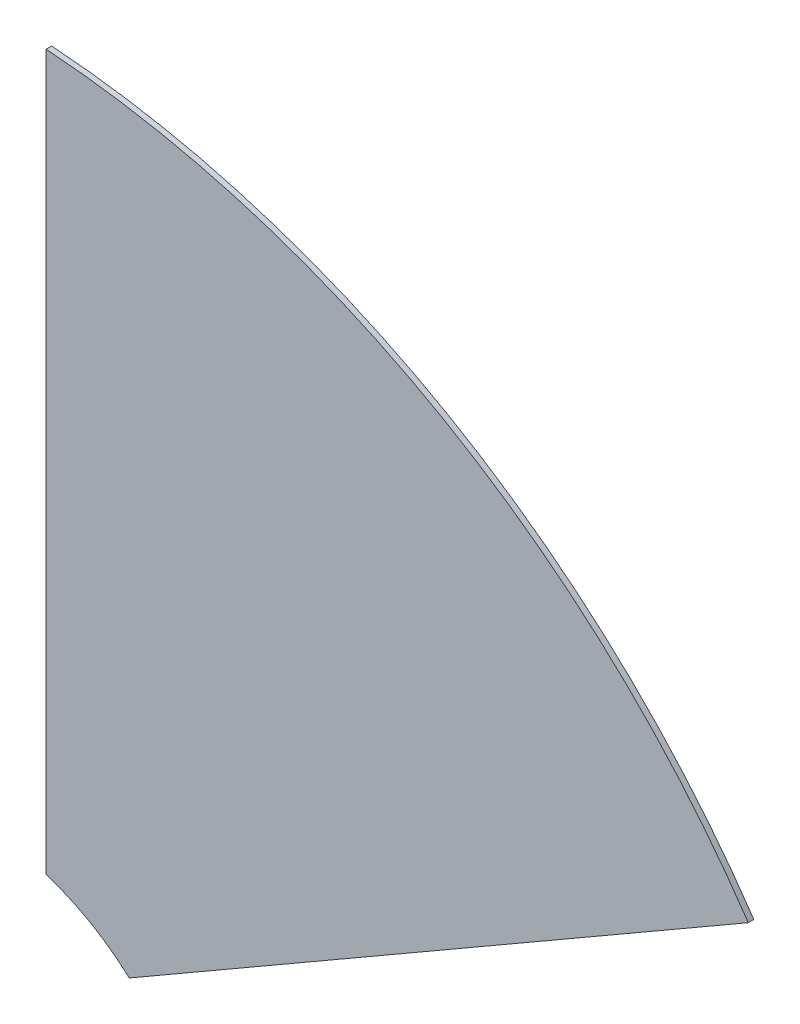
ISO-10303-21;
HEADER;
FILE_DESCRIPTION(('STEP AP214'),'2;1');
FILE_NAME('part.step','',(''),(''),'','','');
FILE_SCHEMA(('AUTOMOTIVE_DESIGN { 1 0 10303 214 1 1 1 1 }'));
ENDSEC;
DATA;
#1=APPLICATION_CONTEXT('core data for automotive mechanical design processes');
#2=APPLICATION_PROTOCOL_DEFINITION('international standard','automotive_design',2000,#1);
#3=PRODUCT_CONTEXT('',#1,'mechanical');
#4=PRODUCT('Part','Part','',(#3));
#5=PRODUCT_RELATED_PRODUCT_CATEGORY('part','',(#4));
#6=PRODUCT_DEFINITION_FORMATION('','',#4);
#7=PRODUCT_DEFINITION_CONTEXT('part definition',#1,'design');
#8=PRODUCT_DEFINITION('design','',#6,#7);
#9=PRODUCT_DEFINITION_SHAPE('','',#8);
#10=(LENGTH_UNIT() NAMED_UNIT(*) SI_UNIT(.MILLI.,.METRE.));
#11=(NAMED_UNIT(*) PLANE_ANGLE_UNIT() SI_UNIT($,.RADIAN.));
#12=(NAMED_UNIT(*) SI_UNIT($,.STERADIAN.) SOLID_ANGLE_UNIT());
#13=UNCERTAINTY_MEASURE_WITH_UNIT(LENGTH_MEASURE(1.E-05),#10,'distance_accuracy_value','');
#14=(GEOMETRIC_REPRESENTATION_CONTEXT(3) GLOBAL_UNCERTAINTY_ASSIGNED_CONTEXT((#13)) GLOBAL_UNIT_ASSIGNED_CONTEXT((#10,
#11,#12)) REPRESENTATION_CONTEXT('',''));
#15=CARTESIAN_POINT('',(0.,0.,0.));
#16=DIRECTION('',(0.,0.,1.));
#17=DIRECTION('',(1.,0.,0.));
#18=AXIS2_PLACEMENT_3D('',#15,#16,#17);
#19=CARTESIAN_POINT('',(-9.99200722162641E-13,-1.66533453693773E-12,1.5875));
#20=DIRECTION('',(0.,0.,-1.));
#21=DIRECTION('',(-1.,0.,0.));
#22=AXIS2_PLACEMENT_3D('',#19,#20,#21);
#23=CYLINDRICAL_SURFACE('',#22,266.700000000002);
#24=CARTESIAN_POINT('',(-9.99200722162641E-13,-1.66533453693773E-12,0.));
#25=DIRECTION('',(0.,0.,1.));
#26=DIRECTION('',(-1.,0.,0.));
#27=AXIS2_PLACEMENT_3D('',#24,#25,#26);
#28=CIRCLE('',#27,266.700000000002);
#29=CARTESIAN_POINT('',(220.854015157631,149.507170358992,0.));
#30=VERTEX_POINT('',#29);
#31=CARTESIAN_POINT('',(19.05,266.018772833798,0.));
#32=VERTEX_POINT('',#31);
#33=EDGE_CURVE('E97',#30,#32,#28,.T.);
#34=ORIENTED_EDGE('',*,*,#33,.T.);
#35=DIRECTION('',(0.,0.,-1.));
#36=VECTOR('',#35,1.);
#37=CARTESIAN_POINT('',(19.05,266.018772833798,1.5875));
#38=LINE('',#37,#36);
#39=CARTESIAN_POINT('',(19.05,266.018772833798,1.5875));
#40=VERTEX_POINT('',#39);
#41=EDGE_CURVE('E11',#40,#32,#38,.T.);
#42=ORIENTED_EDGE('',*,*,#41,.F.);
#43=CARTESIAN_POINT('',(-9.99200722162641E-13,-1.66533453693773E-12,1.5875));
#44=DIRECTION('',(0.,0.,1.));
#45=DIRECTION('',(-1.,0.,0.));
#46=AXIS2_PLACEMENT_3D('',#43,#44,#45);
#47=CIRCLE('',#46,266.700000000002);
#48=CARTESIAN_POINT('',(220.854015157631,149.507170358992,1.5875));
#49=VERTEX_POINT('',#48);
#50=EDGE_CURVE('E85',#49,#40,#47,.T.);
#51=ORIENTED_EDGE('',*,*,#50,.F.);
#52=DIRECTION('',(0.,0.,-1.));
#53=VECTOR('',#52,1.);
#54=CARTESIAN_POINT('',(220.854015157631,149.507170358992,1.5875));
#55=LINE('',#54,#53);
#56=EDGE_CURVE('E93',#49,#30,#55,.T.);
#57=ORIENTED_EDGE('',*,*,#56,.T.);
#58=EDGE_LOOP('',(#34,#42,#51,#57));
#59=FACE_BOUND('',#58,.T.);
#60=ADVANCED_FACE('F34',(#59),#23,.T.);
#61=CARTESIAN_POINT('',(19.05,266.018772833798,1.5875));
#62=DIRECTION('',(1.,0.,0.));
#63=DIRECTION('',(0.,1.,0.));
#64=AXIS2_PLACEMENT_3D('',#61,#62,#63);
#65=PLANE('',#64);
#66=DIRECTION('',(0.,-1.,0.));
#67=VECTOR('',#66,1.);
#68=CARTESIAN_POINT('',(19.05,266.018772833798,0.));
#69=LINE('',#68,#67);
#70=CARTESIAN_POINT('',(19.05,60.575139289976,0.));
#71=VERTEX_POINT('',#70);
#72=EDGE_CURVE('E89',#32,#71,#69,.T.);
#73=ORIENTED_EDGE('',*,*,#72,.T.);
#74=DIRECTION('',(0.,0.,-1.));
#75=VECTOR('',#74,1.);
#76=CARTESIAN_POINT('',(19.05,60.575139289976,1.5875));
#77=LINE('',#76,#75);
#78=CARTESIAN_POINT('',(19.05,60.575139289976,1.5875));
#79=VERTEX_POINT('',#78);
#80=EDGE_CURVE('E42',#79,#71,#77,.T.);
#81=ORIENTED_EDGE('',*,*,#80,.F.);
#82=DIRECTION('',(0.,-1.,0.));
#83=VECTOR('',#82,1.);
#84=CARTESIAN_POINT('',(19.05,266.018772833798,1.5875));
#85=LINE('',#84,#83);
#86=EDGE_CURVE('E80',#40,#79,#85,.T.);
#87=ORIENTED_EDGE('',*,*,#86,.F.);
#88=ORIENTED_EDGE('',*,*,#41,.T.);
#89=EDGE_LOOP('',(#73,#81,#87,#88));
#90=FACE_BOUND('',#89,.T.);
#91=ADVANCED_FACE('F88',(#90),#65,.F.);
#92=CARTESIAN_POINT('',(-3.78169717762944E-13,-6.86950496486816E-13,1.5875));
#93=DIRECTION('',(0.,0.,-1.));
#94=DIRECTION('',(-1.,0.,0.));
#95=AXIS2_PLACEMENT_3D('',#92,#93,#94);
#96=CYLINDRICAL_SURFACE('',#95,63.5000000000008);
#97=CARTESIAN_POINT('',(-3.78169717762944E-13,-6.86950496486816E-13,0.));
#98=DIRECTION('',(0.,0.,-1.));
#99=DIRECTION('',(-1.,0.,0.));
#100=AXIS2_PLACEMENT_3D('',#97,#98,#99);
#101=CIRCLE('',#100,63.5000000000008);
#102=CARTESIAN_POINT('',(42.9346094629003,46.7853535870815,0.));
#103=VERTEX_POINT('',#102);
#104=EDGE_CURVE('E67',#71,#103,#101,.T.);
#105=ORIENTED_EDGE('',*,*,#104,.T.);
#106=DIRECTION('',(0.,0.,-1.));
#107=VECTOR('',#106,1.);
#108=CARTESIAN_POINT('',(42.9346094629003,46.7853535870815,1.5875));
#109=LINE('',#108,#107);
#110=CARTESIAN_POINT('',(42.9346094629003,46.7853535870815,1.5875));
#111=VERTEX_POINT('',#110);
#112=EDGE_CURVE('E90',#111,#103,#109,.T.);
#113=ORIENTED_EDGE('',*,*,#112,.F.);
#114=CARTESIAN_POINT('',(-3.78169717762944E-13,-6.86950496486816E-13,1.5875));
#115=DIRECTION('',(0.,0.,-1.));
#116=DIRECTION('',(-1.,0.,0.));
#117=AXIS2_PLACEMENT_3D('',#114,#115,#116);
#118=CIRCLE('',#117,63.5000000000008);
#119=EDGE_CURVE('E83',#79,#111,#118,.T.);
#120=ORIENTED_EDGE('',*,*,#119,.F.);
#121=ORIENTED_EDGE('',*,*,#80,.T.);
#122=EDGE_LOOP('',(#105,#113,#120,#121));
#123=FACE_BOUND('',#122,.T.);
#124=ADVANCED_FACE('F91',(#123),#96,.F.);
#125=CARTESIAN_POINT('',(220.854015157631,149.507170358992,1.5875));
#126=DIRECTION('',(-0.499999999999998,0.866025403784439,0.));
#127=DIRECTION('',(-0.86602540378444,-0.499999999999998,0.));
#128=AXIS2_PLACEMENT_3D('',#125,#126,#127);
#129=PLANE('',#128);
#130=DIRECTION('',(0.86602540378444,0.499999999999998,0.));
#131=VECTOR('',#130,1.);
#132=CARTESIAN_POINT('',(220.854015157631,149.507170358992,0.));
#133=LINE('',#132,#131);
#134=EDGE_CURVE('E73',#103,#30,#133,.T.);
#135=ORIENTED_EDGE('',*,*,#134,.T.);
#136=ORIENTED_EDGE('',*,*,#56,.F.);
#137=DIRECTION('',(0.86602540378444,0.499999999999998,0.));
#138=VECTOR('',#137,1.);
#139=CARTESIAN_POINT('',(220.854015157631,149.507170358992,1.5875));
#140=LINE('',#139,#138);
#141=EDGE_CURVE('E50',#111,#49,#140,.T.);
#142=ORIENTED_EDGE('',*,*,#141,.F.);
#143=ORIENTED_EDGE('',*,*,#112,.T.);
#144=EDGE_LOOP('',(#135,#136,#142,#143));
#145=FACE_BOUND('',#144,.T.);
#146=ADVANCED_FACE('F104',(#145),#129,.F.);
#147=CARTESIAN_POINT('',(-9.99200722162641E-13,-1.66533453693773E-12,1.5875));
#148=DIRECTION('',(0.,0.,-1.));
#149=DIRECTION('',(-1.,0.,0.));
#150=AXIS2_PLACEMENT_3D('',#147,#148,#149);
#151=PLANE('',#150);
#152=ORIENTED_EDGE('',*,*,#50,.T.);
#153=ORIENTED_EDGE('',*,*,#86,.T.);
#154=ORIENTED_EDGE('',*,*,#119,.T.);
#155=ORIENTED_EDGE('',*,*,#141,.T.);
#156=EDGE_LOOP('',(#152,#153,#154,#155));
#157=FACE_BOUND('',#156,.T.);
#158=ADVANCED_FACE('F81',(#157),#151,.F.);
#159=CARTESIAN_POINT('',(-9.99200722162641E-13,-1.66533453693773E-12,0.));
#160=DIRECTION('',(0.,0.,-1.));
#161=DIRECTION('',(-1.,0.,0.));
#162=AXIS2_PLACEMENT_3D('',#159,#160,#161);
#163=PLANE('',#162);
#164=ORIENTED_EDGE('',*,*,#33,.F.);
#165=ORIENTED_EDGE('',*,*,#134,.F.);
#166=ORIENTED_EDGE('',*,*,#104,.F.);
#167=ORIENTED_EDGE('',*,*,#72,.F.);
#168=EDGE_LOOP('',(#164,#165,#166,#167));
#169=FACE_BOUND('',#168,.T.);
#170=ADVANCED_FACE('F107',(#169),#163,.T.);
#171=CLOSED_SHELL('',(#60,#91,#124,#146,#158,#170));
#172=MANIFOLD_SOLID_BREP('B2',#171);
#173=ADVANCED_BREP_SHAPE_REPRESENTATION('',(#18,#172),#14);
#174=SHAPE_DEFINITION_REPRESENTATION(#9,#173);
ENDSEC;
END-ISO-10303-21;
